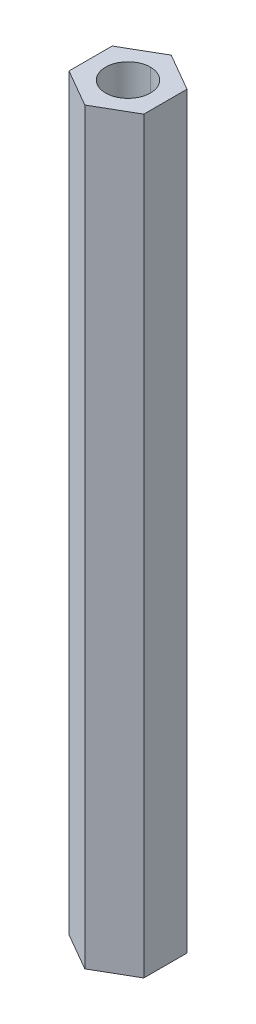
ISO-10303-21;
HEADER;
FILE_DESCRIPTION(('STEP AP214'),'2;1');
FILE_NAME('part.step','',(''),(''),'','','');
FILE_SCHEMA(('AUTOMOTIVE_DESIGN { 1 0 10303 214 1 1 1 1 }'));
ENDSEC;
DATA;
#1=APPLICATION_CONTEXT('core data for automotive mechanical design processes');
#2=APPLICATION_PROTOCOL_DEFINITION('international standard','automotive_design',2000,#1);
#3=PRODUCT_CONTEXT('',#1,'mechanical');
#4=PRODUCT('Part','Part','',(#3));
#5=PRODUCT_RELATED_PRODUCT_CATEGORY('part','',(#4));
#6=PRODUCT_DEFINITION_FORMATION('','',#4);
#7=PRODUCT_DEFINITION_CONTEXT('part definition',#1,'design');
#8=PRODUCT_DEFINITION('design','',#6,#7);
#9=PRODUCT_DEFINITION_SHAPE('','',#8);
#10=(LENGTH_UNIT() NAMED_UNIT(*) SI_UNIT(.MILLI.,.METRE.));
#11=(NAMED_UNIT(*) PLANE_ANGLE_UNIT() SI_UNIT($,.RADIAN.));
#12=(NAMED_UNIT(*) SI_UNIT($,.STERADIAN.) SOLID_ANGLE_UNIT());
#13=UNCERTAINTY_MEASURE_WITH_UNIT(LENGTH_MEASURE(1.E-05),#10,'distance_accuracy_value','');
#14=(GEOMETRIC_REPRESENTATION_CONTEXT(3) GLOBAL_UNCERTAINTY_ASSIGNED_CONTEXT((#13)) GLOBAL_UNIT_ASSIGNED_CONTEXT((#10,
#11,#12)) REPRESENTATION_CONTEXT('',''));
#15=CARTESIAN_POINT('',(0.,0.,0.));
#16=DIRECTION('',(0.,0.,1.));
#17=DIRECTION('',(1.,0.,0.));
#18=AXIS2_PLACEMENT_3D('',#15,#16,#17);
#19=CARTESIAN_POINT('',(0.,0.,0.));
#20=DIRECTION('',(0.,1.,0.));
#21=DIRECTION('',(1.,0.,0.));
#22=AXIS2_PLACEMENT_3D('',#19,#20,#21);
#23=PLANE('',#22);
#24=CARTESIAN_POINT('',(0.,0.,0.));
#25=DIRECTION('',(0.,1.,0.));
#26=DIRECTION('',(0.,0.,1.));
#27=AXIS2_PLACEMENT_3D('',#24,#25,#26);
#28=CIRCLE('',#27,1.5);
#29=CARTESIAN_POINT('',(0.,0.,-1.5));
#30=VERTEX_POINT('',#29);
#31=CARTESIAN_POINT('',(0.,0.,1.5));
#32=VERTEX_POINT('',#31);
#33=EDGE_CURVE('E167',#30,#32,#28,.T.);
#34=ORIENTED_EDGE('',*,*,#33,.T.);
#35=CARTESIAN_POINT('',(0.,0.,0.));
#36=DIRECTION('',(0.,1.,0.));
#37=DIRECTION('',(0.,0.,1.));
#38=AXIS2_PLACEMENT_3D('',#35,#36,#37);
#39=CIRCLE('',#38,1.5);
#40=EDGE_CURVE('E11',#32,#30,#39,.T.);
#41=ORIENTED_EDGE('',*,*,#40,.T.);
#42=EDGE_LOOP('',(#34,#41));
#43=FACE_BOUND('',#42,.T.);
#44=DIRECTION('',(-0.866025403784439,0.,-0.5));
#45=VECTOR('',#44,1.);
#46=CARTESIAN_POINT('',(1.25,0.,-2.1650635094611));
#47=LINE('',#46,#45);
#48=CARTESIAN_POINT('',(2.5,0.,-1.44337567297406));
#49=VERTEX_POINT('',#48);
#50=CARTESIAN_POINT('',(0.,0.,-2.88675134594813));
#51=VERTEX_POINT('',#50);
#52=EDGE_CURVE('E169',#49,#51,#47,.T.);
#53=ORIENTED_EDGE('',*,*,#52,.F.);
#54=DIRECTION('',(0.,0.,-1.));
#55=VECTOR('',#54,1.);
#56=CARTESIAN_POINT('',(2.5,0.,0.));
#57=LINE('',#56,#55);
#58=CARTESIAN_POINT('',(2.5,0.,1.44337567297406));
#59=VERTEX_POINT('',#58);
#60=EDGE_CURVE('E117',#59,#49,#57,.T.);
#61=ORIENTED_EDGE('',*,*,#60,.F.);
#62=DIRECTION('',(0.866025403784439,0.,-0.5));
#63=VECTOR('',#62,1.);
#64=CARTESIAN_POINT('',(1.25,0.,2.1650635094611));
#65=LINE('',#64,#63);
#66=CARTESIAN_POINT('',(0.,0.,2.88675134594813));
#67=VERTEX_POINT('',#66);
#68=EDGE_CURVE('E125',#67,#59,#65,.T.);
#69=ORIENTED_EDGE('',*,*,#68,.F.);
#70=DIRECTION('',(0.866025403784439,0.,0.5));
#71=VECTOR('',#70,1.);
#72=CARTESIAN_POINT('',(-1.25,0.,2.1650635094611));
#73=LINE('',#72,#71);
#74=CARTESIAN_POINT('',(-2.5,0.,1.44337567297406));
#75=VERTEX_POINT('',#74);
#76=EDGE_CURVE('E92',#75,#67,#73,.T.);
#77=ORIENTED_EDGE('',*,*,#76,.F.);
#78=DIRECTION('',(0.,0.,1.));
#79=VECTOR('',#78,1.);
#80=CARTESIAN_POINT('',(-2.5,0.,0.));
#81=LINE('',#80,#79);
#82=CARTESIAN_POINT('',(-2.5,0.,-1.44337567297406));
#83=VERTEX_POINT('',#82);
#84=EDGE_CURVE('E136',#83,#75,#81,.T.);
#85=ORIENTED_EDGE('',*,*,#84,.F.);
#86=DIRECTION('',(-0.866025403784439,0.,0.5));
#87=VECTOR('',#86,1.);
#88=CARTESIAN_POINT('',(-1.25,0.,-2.1650635094611));
#89=LINE('',#88,#87);
#90=EDGE_CURVE('E202',#51,#83,#89,.T.);
#91=ORIENTED_EDGE('',*,*,#90,.F.);
#92=EDGE_LOOP('',(#53,#61,#69,#77,#85,#91));
#93=FACE_BOUND('',#92,.T.);
#94=ADVANCED_FACE('F17',(#43,#93),#23,.F.);
#95=CARTESIAN_POINT('',(0.,50.,0.));
#96=DIRECTION('',(0.,1.,0.));
#97=DIRECTION('',(1.,0.,0.));
#98=AXIS2_PLACEMENT_3D('',#95,#96,#97);
#99=PLANE('',#98);
#100=CARTESIAN_POINT('',(0.,50.,0.));
#101=DIRECTION('',(0.,1.,0.));
#102=DIRECTION('',(0.,0.,1.));
#103=AXIS2_PLACEMENT_3D('',#100,#101,#102);
#104=CIRCLE('',#103,1.5);
#105=CARTESIAN_POINT('',(0.,50.,-1.5));
#106=VERTEX_POINT('',#105);
#107=CARTESIAN_POINT('',(0.,50.,1.5));
#108=VERTEX_POINT('',#107);
#109=EDGE_CURVE('E165',#106,#108,#104,.T.);
#110=ORIENTED_EDGE('',*,*,#109,.F.);
#111=CARTESIAN_POINT('',(0.,50.,0.));
#112=DIRECTION('',(0.,1.,0.));
#113=DIRECTION('',(0.,0.,1.));
#114=AXIS2_PLACEMENT_3D('',#111,#112,#113);
#115=CIRCLE('',#114,1.5);
#116=EDGE_CURVE('E26',#108,#106,#115,.T.);
#117=ORIENTED_EDGE('',*,*,#116,.F.);
#118=EDGE_LOOP('',(#110,#117));
#119=FACE_BOUND('',#118,.T.);
#120=DIRECTION('',(-0.866025403784439,0.,-0.5));
#121=VECTOR('',#120,1.);
#122=CARTESIAN_POINT('',(1.25,50.,-2.1650635094611));
#123=LINE('',#122,#121);
#124=CARTESIAN_POINT('',(2.5,50.,-1.44337567297406));
#125=VERTEX_POINT('',#124);
#126=CARTESIAN_POINT('',(0.,50.,-2.88675134594813));
#127=VERTEX_POINT('',#126);
#128=EDGE_CURVE('E195',#125,#127,#123,.T.);
#129=ORIENTED_EDGE('',*,*,#128,.T.);
#130=DIRECTION('',(-0.866025403784439,0.,0.5));
#131=VECTOR('',#130,1.);
#132=CARTESIAN_POINT('',(-1.25,50.,-2.1650635094611));
#133=LINE('',#132,#131);
#134=CARTESIAN_POINT('',(-2.5,50.,-1.44337567297406));
#135=VERTEX_POINT('',#134);
#136=EDGE_CURVE('E187',#127,#135,#133,.T.);
#137=ORIENTED_EDGE('',*,*,#136,.T.);
#138=DIRECTION('',(0.,0.,1.));
#139=VECTOR('',#138,1.);
#140=CARTESIAN_POINT('',(-2.5,50.,0.));
#141=LINE('',#140,#139);
#142=CARTESIAN_POINT('',(-2.5,50.,1.44337567297406));
#143=VERTEX_POINT('',#142);
#144=EDGE_CURVE('E122',#135,#143,#141,.T.);
#145=ORIENTED_EDGE('',*,*,#144,.T.);
#146=DIRECTION('',(0.866025403784439,0.,0.5));
#147=VECTOR('',#146,1.);
#148=CARTESIAN_POINT('',(-1.25,50.,2.1650635094611));
#149=LINE('',#148,#147);
#150=CARTESIAN_POINT('',(0.,50.,2.88675134594813));
#151=VERTEX_POINT('',#150);
#152=EDGE_CURVE('E79',#143,#151,#149,.T.);
#153=ORIENTED_EDGE('',*,*,#152,.T.);
#154=DIRECTION('',(0.866025403784439,0.,-0.5));
#155=VECTOR('',#154,1.);
#156=CARTESIAN_POINT('',(1.25,50.,2.1650635094611));
#157=LINE('',#156,#155);
#158=CARTESIAN_POINT('',(2.5,50.,1.44337567297406));
#159=VERTEX_POINT('',#158);
#160=EDGE_CURVE('E110',#151,#159,#157,.T.);
#161=ORIENTED_EDGE('',*,*,#160,.T.);
#162=DIRECTION('',(0.,0.,-1.));
#163=VECTOR('',#162,1.);
#164=CARTESIAN_POINT('',(2.5,50.,0.));
#165=LINE('',#164,#163);
#166=EDGE_CURVE('E39',#159,#125,#165,.T.);
#167=ORIENTED_EDGE('',*,*,#166,.T.);
#168=EDGE_LOOP('',(#129,#137,#145,#153,#161,#167));
#169=FACE_BOUND('',#168,.T.);
#170=ADVANCED_FACE('F120',(#119,#169),#99,.T.);
#171=CARTESIAN_POINT('',(0.,50.,0.));
#172=DIRECTION('',(0.,-1.,0.));
#173=DIRECTION('',(0.,0.,-1.));
#174=AXIS2_PLACEMENT_3D('',#171,#172,#173);
#175=CYLINDRICAL_SURFACE('',#174,1.5);
#176=DIRECTION('',(0.,-1.,0.));
#177=VECTOR('',#176,1.);
#178=CARTESIAN_POINT('',(0.,50.,1.5));
#179=LINE('',#178,#177);
#180=EDGE_CURVE('E159',#108,#32,#179,.T.);
#181=ORIENTED_EDGE('',*,*,#180,.F.);
#182=ORIENTED_EDGE('',*,*,#116,.T.);
#183=DIRECTION('',(0.,-1.,0.));
#184=VECTOR('',#183,1.);
#185=CARTESIAN_POINT('',(0.,50.,-1.5));
#186=LINE('',#185,#184);
#187=EDGE_CURVE('E156',#106,#30,#186,.T.);
#188=ORIENTED_EDGE('',*,*,#187,.T.);
#189=ORIENTED_EDGE('',*,*,#40,.F.);
#190=EDGE_LOOP('',(#181,#182,#188,#189));
#191=FACE_BOUND('',#190,.T.);
#192=ADVANCED_FACE('F154',(#191),#175,.F.);
#193=CARTESIAN_POINT('',(2.5,50.,0.));
#194=DIRECTION('',(-1.,0.,0.));
#195=DIRECTION('',(0.,0.,1.));
#196=AXIS2_PLACEMENT_3D('',#193,#194,#195);
#197=PLANE('',#196);
#198=ORIENTED_EDGE('',*,*,#60,.T.);
#199=DIRECTION('',(0.,-1.,0.));
#200=VECTOR('',#199,1.);
#201=CARTESIAN_POINT('',(2.5,50.,-1.44337567297406));
#202=LINE('',#201,#200);
#203=EDGE_CURVE('E198',#125,#49,#202,.T.);
#204=ORIENTED_EDGE('',*,*,#203,.F.);
#205=ORIENTED_EDGE('',*,*,#166,.F.);
#206=DIRECTION('',(0.,-1.,0.));
#207=VECTOR('',#206,1.);
#208=CARTESIAN_POINT('',(2.5,50.,1.44337567297406));
#209=LINE('',#208,#207);
#210=EDGE_CURVE('E114',#159,#59,#209,.T.);
#211=ORIENTED_EDGE('',*,*,#210,.T.);
#212=EDGE_LOOP('',(#198,#204,#205,#211));
#213=FACE_BOUND('',#212,.T.);
#214=ADVANCED_FACE('F253',(#213),#197,.F.);
#215=CARTESIAN_POINT('',(1.25,50.,2.1650635094611));
#216=DIRECTION('',(-0.5,0.,-0.866025403784439));
#217=DIRECTION('',(-0.866025403784439,0.,0.5));
#218=AXIS2_PLACEMENT_3D('',#215,#216,#217);
#219=PLANE('',#218);
#220=ORIENTED_EDGE('',*,*,#68,.T.);
#221=ORIENTED_EDGE('',*,*,#210,.F.);
#222=ORIENTED_EDGE('',*,*,#160,.F.);
#223=DIRECTION('',(0.,-1.,0.));
#224=VECTOR('',#223,1.);
#225=CARTESIAN_POINT('',(0.,50.,2.88675134594813));
#226=LINE('',#225,#224);
#227=EDGE_CURVE('E113',#151,#67,#226,.T.);
#228=ORIENTED_EDGE('',*,*,#227,.T.);
#229=EDGE_LOOP('',(#220,#221,#222,#228));
#230=FACE_BOUND('',#229,.T.);
#231=ADVANCED_FACE('F112',(#230),#219,.F.);
#232=CARTESIAN_POINT('',(-1.25,50.,2.1650635094611));
#233=DIRECTION('',(0.5,0.,-0.866025403784439));
#234=DIRECTION('',(0.,-1.,0.));
#235=AXIS2_PLACEMENT_3D('',#232,#233,#234);
#236=PLANE('',#235);
#237=ORIENTED_EDGE('',*,*,#76,.T.);
#238=ORIENTED_EDGE('',*,*,#227,.F.);
#239=ORIENTED_EDGE('',*,*,#152,.F.);
#240=DIRECTION('',(0.,-1.,0.));
#241=VECTOR('',#240,1.);
#242=CARTESIAN_POINT('',(-2.5,50.,1.44337567297406));
#243=LINE('',#242,#241);
#244=EDGE_CURVE('E180',#143,#75,#243,.T.);
#245=ORIENTED_EDGE('',*,*,#244,.T.);
#246=EDGE_LOOP('',(#237,#238,#239,#245));
#247=FACE_BOUND('',#246,.T.);
#248=ADVANCED_FACE('F127',(#247),#236,.F.);
#249=CARTESIAN_POINT('',(-2.5,50.,0.));
#250=DIRECTION('',(1.,0.,0.));
#251=DIRECTION('',(0.,1.,0.));
#252=AXIS2_PLACEMENT_3D('',#249,#250,#251);
#253=PLANE('',#252);
#254=ORIENTED_EDGE('',*,*,#84,.T.);
#255=ORIENTED_EDGE('',*,*,#244,.F.);
#256=ORIENTED_EDGE('',*,*,#144,.F.);
#257=DIRECTION('',(0.,-1.,0.));
#258=VECTOR('',#257,1.);
#259=CARTESIAN_POINT('',(-2.5,50.,-1.44337567297406));
#260=LINE('',#259,#258);
#261=EDGE_CURVE('E189',#135,#83,#260,.T.);
#262=ORIENTED_EDGE('',*,*,#261,.T.);
#263=EDGE_LOOP('',(#254,#255,#256,#262));
#264=FACE_BOUND('',#263,.T.);
#265=ADVANCED_FACE('F212',(#264),#253,.F.);
#266=CARTESIAN_POINT('',(-1.25,50.,-2.1650635094611));
#267=DIRECTION('',(0.5,0.,0.866025403784439));
#268=DIRECTION('',(0.,-1.,0.));
#269=AXIS2_PLACEMENT_3D('',#266,#267,#268);
#270=PLANE('',#269);
#271=ORIENTED_EDGE('',*,*,#90,.T.);
#272=ORIENTED_EDGE('',*,*,#261,.F.);
#273=ORIENTED_EDGE('',*,*,#136,.F.);
#274=DIRECTION('',(0.,-1.,0.));
#275=VECTOR('',#274,1.);
#276=CARTESIAN_POINT('',(0.,50.,-2.88675134594813));
#277=LINE('',#276,#275);
#278=EDGE_CURVE('E191',#127,#51,#277,.T.);
#279=ORIENTED_EDGE('',*,*,#278,.T.);
#280=EDGE_LOOP('',(#271,#272,#273,#279));
#281=FACE_BOUND('',#280,.T.);
#282=ADVANCED_FACE('F214',(#281),#270,.F.);
#283=CARTESIAN_POINT('',(1.25,50.,-2.1650635094611));
#284=DIRECTION('',(-0.5,0.,0.866025403784439));
#285=DIRECTION('',(0.,1.,0.));
#286=AXIS2_PLACEMENT_3D('',#283,#284,#285);
#287=PLANE('',#286);
#288=ORIENTED_EDGE('',*,*,#52,.T.);
#289=ORIENTED_EDGE('',*,*,#278,.F.);
#290=ORIENTED_EDGE('',*,*,#128,.F.);
#291=ORIENTED_EDGE('',*,*,#203,.T.);
#292=EDGE_LOOP('',(#288,#289,#290,#291));
#293=FACE_BOUND('',#292,.T.);
#294=ADVANCED_FACE('F268',(#293),#287,.F.);
#295=CARTESIAN_POINT('',(0.,50.,0.));
#296=DIRECTION('',(0.,-1.,0.));
#297=DIRECTION('',(0.,0.,-1.));
#298=AXIS2_PLACEMENT_3D('',#295,#296,#297);
#299=CYLINDRICAL_SURFACE('',#298,1.5);
#300=ORIENTED_EDGE('',*,*,#109,.T.);
#301=ORIENTED_EDGE('',*,*,#180,.T.);
#302=ORIENTED_EDGE('',*,*,#33,.F.);
#303=ORIENTED_EDGE('',*,*,#187,.F.);
#304=EDGE_LOOP('',(#300,#301,#302,#303));
#305=FACE_BOUND('',#304,.T.);
#306=ADVANCED_FACE('F164',(#305),#299,.F.);
#307=CLOSED_SHELL('',(#94,#170,#192,#214,#231,#248,#265,#282,#294,#306));
#308=MANIFOLD_SOLID_BREP('B1',#307);
#309=ADVANCED_BREP_SHAPE_REPRESENTATION('',(#18,#308),#14);
#310=SHAPE_DEFINITION_REPRESENTATION(#9,#309);
ENDSEC;
END-ISO-10303-21;
